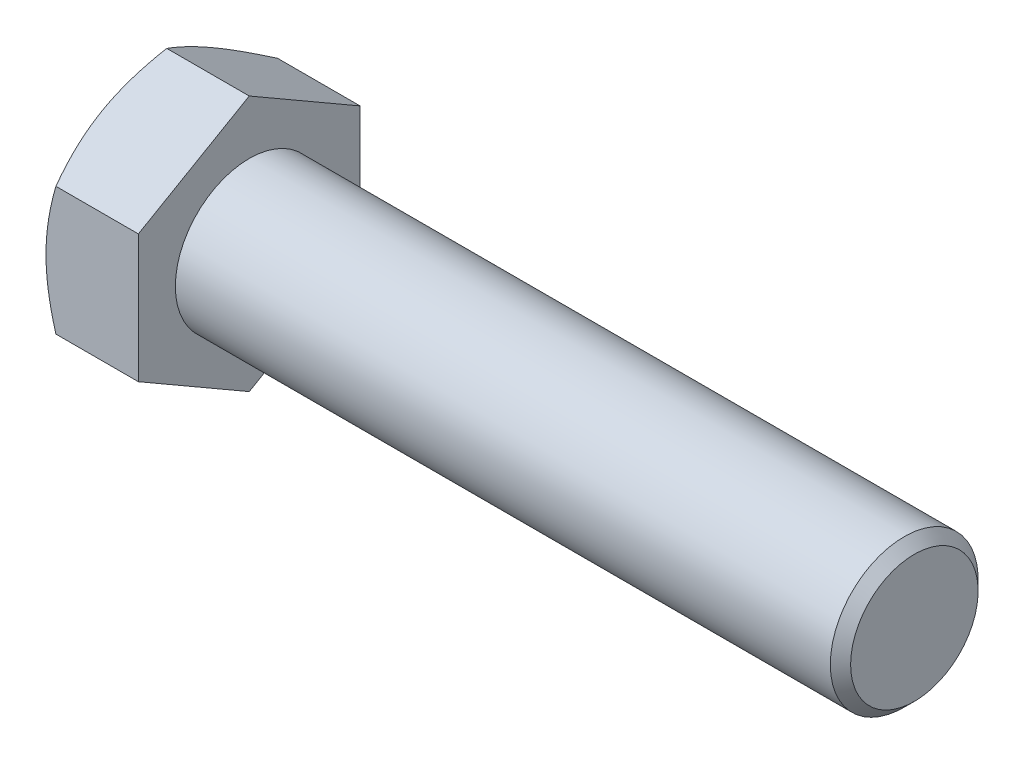
ISO-10303-21;
HEADER;
FILE_DESCRIPTION(('STEP AP214'),'2;1');
FILE_NAME('part.step','',(''),(''),'','','');
FILE_SCHEMA(('AUTOMOTIVE_DESIGN { 1 0 10303 214 1 1 1 1 }'));
ENDSEC;
DATA;
#1=APPLICATION_CONTEXT('core data for automotive mechanical design processes');
#2=APPLICATION_PROTOCOL_DEFINITION('international standard','automotive_design',2000,#1);
#3=PRODUCT_CONTEXT('',#1,'mechanical');
#4=PRODUCT('Part','Part','',(#3));
#5=PRODUCT_RELATED_PRODUCT_CATEGORY('part','',(#4));
#6=PRODUCT_DEFINITION_FORMATION('','',#4);
#7=PRODUCT_DEFINITION_CONTEXT('part definition',#1,'design');
#8=PRODUCT_DEFINITION('design','',#6,#7);
#9=PRODUCT_DEFINITION_SHAPE('','',#8);
#10=(LENGTH_UNIT() NAMED_UNIT(*) SI_UNIT(.MILLI.,.METRE.));
#11=(NAMED_UNIT(*) PLANE_ANGLE_UNIT() SI_UNIT($,.RADIAN.));
#12=(NAMED_UNIT(*) SI_UNIT($,.STERADIAN.) SOLID_ANGLE_UNIT());
#13=UNCERTAINTY_MEASURE_WITH_UNIT(LENGTH_MEASURE(1.E-05),#10,'distance_accuracy_value','');
#14=(GEOMETRIC_REPRESENTATION_CONTEXT(3) GLOBAL_UNCERTAINTY_ASSIGNED_CONTEXT((#13)) GLOBAL_UNIT_ASSIGNED_CONTEXT((#10,
#11,#12)) REPRESENTATION_CONTEXT('',''));
#15=CARTESIAN_POINT('',(0.,0.,0.));
#16=DIRECTION('',(0.,0.,1.));
#17=DIRECTION('',(1.,0.,0.));
#18=AXIS2_PLACEMENT_3D('',#15,#16,#17);
#19=CARTESIAN_POINT('',(12.5,8.66025403784437,-15.));
#20=DIRECTION('',(0.,-0.866025403784438,0.500000000000001));
#21=DIRECTION('',(0.,-0.500000000000001,-0.866025403784438));
#22=AXIS2_PLACEMENT_3D('',#19,#20,#21);
#23=PLANE('',#22);
#24=CARTESIAN_POINT('',(1.33981262948894,17.3206235457426,0.000199999999999942));
#25=CARTESIAN_POINT('',(1.22992178974394,17.130274565913,-0.329494104233798));
#26=CARTESIAN_POINT('',(1.12501758932861,16.939183122782,-0.660474192628298));
#27=CARTESIAN_POINT('',(0.926568581943105,16.5554679079492,-1.32508844035602));
#28=CARTESIAN_POINT('',(0.833027511049495,16.3628436543361,-1.6587234343838));
#29=CARTESIAN_POINT('',(0.658562147609862,15.9756905506624,-2.32929228025473));
#30=CARTESIAN_POINT('',(0.57766770660219,15.7811583127512,-2.66623200002701));
#31=CARTESIAN_POINT('',(0.430232643422046,15.3907420734253,-3.34245276263938));
#32=CARTESIAN_POINT('',(0.363691202381329,15.1948581497855,-3.68173367076951));
#33=CARTESIAN_POINT('',(0.24779237469631,14.8067578304067,-4.35394314236732));
#34=CARTESIAN_POINT('',(0.198051383436667,14.6145702475688,-4.68682180042634));
#35=CARTESIAN_POINT('',(0.114646749003608,14.2293144416655,-5.3541044301617));
#36=CARTESIAN_POINT('',(0.0809834152900872,14.0362462017216,-5.68850843107249));
#37=CARTESIAN_POINT('',(0.0305840757080842,13.6497853945792,-6.35787818417715));
#38=CARTESIAN_POINT('',(0.0138279549580496,13.4563934876199,-6.69284279280335));
#39=CARTESIAN_POINT('',(-0.00239660617302373,13.0694311550724,-7.363081213391));
#40=CARTESIAN_POINT('',(-0.00186558072758146,12.8758607351851,-7.69835501547824));
#41=CARTESIAN_POINT('',(0.0152766129981647,12.5139822792559,-8.3251468873122));
#42=CARTESIAN_POINT('',(0.0297968460490102,12.3456484541475,-8.61670962503242));
#43=CARTESIAN_POINT('',(0.0716371404224067,12.0093680110861,-9.19916443800648));
#44=CARTESIAN_POINT('',(0.0989581071094724,11.8414214213658,-9.49005646435989));
#45=CARTESIAN_POINT('',(0.165923511998901,11.5060066717823,-10.0710118522466));
#46=CARTESIAN_POINT('',(0.205578128270658,11.338539022767,-10.3610743289652));
#47=CARTESIAN_POINT('',(0.296515103017898,11.0043888432043,-10.939839417326));
#48=CARTESIAN_POINT('',(0.347798251969253,10.8377063668174,-11.2285419351595));
#49=CARTESIAN_POINT('',(0.520386864747102,10.3317324659531,-12.1049144387604));
#50=CARTESIAN_POINT('',(0.658901178256925,9.99390625559023,-12.6900465992373));
#51=CARTESIAN_POINT('',(0.973271968475207,9.32329122184509,-13.8515859100034));
#52=CARTESIAN_POINT('',(1.14905461461787,8.99049381241394,-14.4280079317654));
#53=CARTESIAN_POINT('',(1.33981262948893,8.66013856779053,-15.0002));
#54=B_SPLINE_CURVE_WITH_KNOTS('',3,(#24,#25,#26,#27,#28,#29,#30,#31,#32,#33,#34,#35,#36,#37,#38,
#39,#40,#41,#42,#43,#44,#45,#46,#47,#48,#49,#50,#51,#52,#53),.UNSPECIFIED.,.F.,.F.,(4,2,2,2,2,2,
2,2,2,2,2,2,2,2,4),(0.,1.18875411504163,2.37789802800057,3.56980778300395,4.76164951910136,
5.92407379683759,7.08652044780812,8.24758247406078,9.40860862348376,10.4193068498566,
11.4300765712312,12.4416826308653,13.4533574773408,15.5211962051185,17.5849760846241),.UNSPECIFIED.);
#55=CARTESIAN_POINT('',(1.33974596215561,17.3205080756888,0.));
#56=VERTEX_POINT('',#55);
#57=CARTESIAN_POINT('',(0.,12.9903810567666,-7.50000000000002));
#58=VERTEX_POINT('',#57);
#59=EDGE_CURVE('E50',#56,#58,#54,.T.);
#60=ORIENTED_EDGE('',*,*,#59,.F.);
#61=DIRECTION('',(-1.,0.,0.));
#62=VECTOR('',#61,1.);
#63=CARTESIAN_POINT('',(12.5,17.3205080756888,0.));
#64=LINE('',#63,#62);
#65=CARTESIAN_POINT('',(12.5,17.3205080756888,0.));
#66=VERTEX_POINT('',#65);
#67=EDGE_CURVE('E146',#66,#56,#64,.T.);
#68=ORIENTED_EDGE('',*,*,#67,.F.);
#69=DIRECTION('',(0.,0.500000000000001,0.866025403784438));
#70=VECTOR('',#69,1.);
#71=CARTESIAN_POINT('',(12.5,8.66025403784437,-15.));
#72=LINE('',#71,#70);
#73=CARTESIAN_POINT('',(12.5,8.66025403784437,-15.));
#74=VERTEX_POINT('',#73);
#75=EDGE_CURVE('E237',#74,#66,#72,.T.);
#76=ORIENTED_EDGE('',*,*,#75,.F.);
#77=DIRECTION('',(-1.,0.,0.));
#78=VECTOR('',#77,1.);
#79=CARTESIAN_POINT('',(12.5,8.66025403784437,-15.));
#80=LINE('',#79,#78);
#81=CARTESIAN_POINT('',(1.3397459621556,8.66025403784437,-15.));
#82=VERTEX_POINT('',#81);
#83=EDGE_CURVE('E134',#74,#82,#80,.T.);
#84=ORIENTED_EDGE('',*,*,#83,.T.);
#85=EDGE_CURVE('E128',#58,#82,#54,.T.);
#86=ORIENTED_EDGE('',*,*,#85,.F.);
#87=EDGE_LOOP('',(#60,#68,#76,#84,#86));
#88=FACE_BOUND('',#87,.T.);
#89=ADVANCED_FACE('F34',(#88),#23,.F.);
#90=CARTESIAN_POINT('',(12.5,17.3205080756888,0.));
#91=DIRECTION('',(0.,-0.866025403784438,-0.500000000000002));
#92=DIRECTION('',(0.,0.500000000000002,-0.866025403784438));
#93=AXIS2_PLACEMENT_3D('',#90,#91,#92);
#94=PLANE('',#93);
#95=CARTESIAN_POINT('',(1.33981262948893,8.66013856779052,15.0002));
#96=CARTESIAN_POINT('',(1.22992178974393,8.85048754762014,14.6705058957662));
#97=CARTESIAN_POINT('',(1.1250175893286,9.04157899075111,14.3395258073717));
#98=CARTESIAN_POINT('',(0.926568581943094,9.42529420558397,13.674911559644));
#99=CARTESIAN_POINT('',(0.833027511049484,9.61791845919699,13.3412765656162));
#100=CARTESIAN_POINT('',(0.658562147609853,10.0050715628707,12.6707077197453));
#101=CARTESIAN_POINT('',(0.577667706602182,10.1996038007819,12.333767999973));
#102=CARTESIAN_POINT('',(0.430232643422039,10.5900200401078,11.6575472373606));
#103=CARTESIAN_POINT('',(0.36369120238132,10.7859039637476,11.3182663292305));
#104=CARTESIAN_POINT('',(0.247792374696303,11.1740042831265,10.6460568576327));
#105=CARTESIAN_POINT('',(0.198051383436661,11.3661918659643,10.3131781995737));
#106=CARTESIAN_POINT('',(0.114646749003604,11.7514476718676,9.64589556983832));
#107=CARTESIAN_POINT('',(0.0809834152900836,11.9445159118115,9.31149156892752));
#108=CARTESIAN_POINT('',(0.0305840757080808,12.3309767189539,8.64212181582286));
#109=CARTESIAN_POINT('',(0.0138279549580458,12.5243686259132,8.30715720719666));
#110=CARTESIAN_POINT('',(-0.00239660617302695,12.9113309584607,7.63691878660901));
#111=CARTESIAN_POINT('',(-0.00186558072758385,13.104901378348,7.30164498452177));
#112=CARTESIAN_POINT('',(0.0152766129981631,13.4667798342772,6.67485311268781));
#113=CARTESIAN_POINT('',(0.0297968460490087,13.6351136593857,6.38329037496759));
#114=CARTESIAN_POINT('',(0.0716371404224057,13.971394102447,5.80083556199353));
#115=CARTESIAN_POINT('',(0.0989581071094717,14.1393406921673,5.50994353564012));
#116=CARTESIAN_POINT('',(0.165923511998901,14.4747554417509,4.92898814775339));
#117=CARTESIAN_POINT('',(0.205578128270658,14.6422230907661,4.63892567103483));
#118=CARTESIAN_POINT('',(0.2965151030179,14.9763732703288,4.06016058267397));
#119=CARTESIAN_POINT('',(0.347798251969255,15.1430557467157,3.77145806484048));
#120=CARTESIAN_POINT('',(0.520386864747105,15.6490296475801,2.8950855612396));
#121=CARTESIAN_POINT('',(0.658901178256929,15.9868558579429,2.30995340076275));
#122=CARTESIAN_POINT('',(0.973271968475213,16.6574708916881,1.14841408999664));
#123=CARTESIAN_POINT('',(1.14905461461788,16.9902683011192,0.571992068234589));
#124=CARTESIAN_POINT('',(1.33981262948894,17.3206235457426,-0.000199999999999061));
#125=B_SPLINE_CURVE_WITH_KNOTS('',3,(#95,#96,#97,#98,#99,#100,#101,#102,#103,#104,#105,#106,
#107,#108,#109,#110,#111,#112,#113,#114,#115,#116,#117,#118,#119,#120,#121,#122,#123,#124),
.UNSPECIFIED.,.F.,.F.,(4,2,2,2,2,2,2,2,2,2,2,2,2,2,4),(0.,1.18875411504162,2.37789802800056,
3.56980778300394,4.76164951910135,5.92407379683757,7.0865204478081,8.24758247406077,
9.40860862348375,10.4193068498566,11.4300765712312,12.4416826308653,13.4533574773408,
15.5211962051185,17.5849760846241),.UNSPECIFIED.);
#126=CARTESIAN_POINT('',(1.3397459621556,8.66025403784436,15.));
#127=VERTEX_POINT('',#126);
#128=CARTESIAN_POINT('',(0.,12.9903810567666,7.50000000000002));
#129=VERTEX_POINT('',#128);
#130=EDGE_CURVE('E57',#127,#129,#125,.T.);
#131=ORIENTED_EDGE('',*,*,#130,.F.);
#132=DIRECTION('',(-1.,0.,0.));
#133=VECTOR('',#132,1.);
#134=CARTESIAN_POINT('',(12.5,8.66025403784436,15.));
#135=LINE('',#134,#133);
#136=CARTESIAN_POINT('',(12.5,8.66025403784436,15.));
#137=VERTEX_POINT('',#136);
#138=EDGE_CURVE('E144',#137,#127,#135,.T.);
#139=ORIENTED_EDGE('',*,*,#138,.F.);
#140=DIRECTION('',(0.,-0.500000000000002,0.866025403784438));
#141=VECTOR('',#140,1.);
#142=CARTESIAN_POINT('',(12.5,17.3205080756888,0.));
#143=LINE('',#142,#141);
#144=EDGE_CURVE('E235',#66,#137,#143,.T.);
#145=ORIENTED_EDGE('',*,*,#144,.F.);
#146=ORIENTED_EDGE('',*,*,#67,.T.);
#147=EDGE_CURVE('E161',#129,#56,#125,.T.);
#148=ORIENTED_EDGE('',*,*,#147,.F.);
#149=EDGE_LOOP('',(#131,#139,#145,#146,#148));
#150=FACE_BOUND('',#149,.T.);
#151=ADVANCED_FACE('F167',(#150),#94,.F.);
#152=CARTESIAN_POINT('',(12.5,8.66025403784436,15.));
#153=DIRECTION('',(0.,0.,-1.));
#154=DIRECTION('',(0.,1.,0.));
#155=AXIS2_PLACEMENT_3D('',#152,#153,#154);
#156=PLANE('',#155);
#157=CARTESIAN_POINT('',(7.37312634142274,-23.3710902432644,15.));
#158=CARTESIAN_POINT('',(7.21375262239754,-23.0430760696959,15.));
#159=CARTESIAN_POINT('',(7.05516544065869,-22.7146799177878,15.));
#160=CARTESIAN_POINT('',(6.73974206992199,-22.0570439860333,15.));
#161=CARTESIAN_POINT('',(6.58290589820193,-21.7278041979018,15.));
#162=CARTESIAN_POINT('',(6.11525014314407,-20.7386136979432,15.));
#163=CARTESIAN_POINT('',(5.80732977425762,-20.0772872007942,15.));
#164=CARTESIAN_POINT('',(5.19942693023618,-18.7466975911013,15.));
#165=CARTESIAN_POINT('',(4.89949586126698,-18.0774109369937,15.));
#166=CARTESIAN_POINT('',(4.31175828291556,-16.7335531331124,15.));
#167=CARTESIAN_POINT('',(4.02395120803105,-16.0589822315577,15.));
#168=CARTESIAN_POINT('',(3.45448123526224,-14.6812618349881,15.));
#169=CARTESIAN_POINT('',(3.17332879671134,-13.9779002519057,15.));
#170=CARTESIAN_POINT('',(2.63203971838782,-12.5629833864443,15.));
#171=CARTESIAN_POINT('',(2.37190542218014,-11.8514272004293,15.));
#172=CARTESIAN_POINT('',(1.87940642787692,-10.4203092780316,15.));
#173=CARTESIAN_POINT('',(1.64698643360295,-9.70076672348861,15.));
#174=CARTESIAN_POINT('',(1.21728875052384,-8.25129237895164,15.));
#175=CARTESIAN_POINT('',(1.0200001067189,-7.52136390453811,15.));
#176=CARTESIAN_POINT('',(0.7580440110938,-6.42057854331659,15.));
#177=CARTESIAN_POINT('',(0.676568269179388,-6.05369801830712,15.));
#178=CARTESIAN_POINT('',(0.525901265988502,-5.31741005070265,15.));
#179=CARTESIAN_POINT('',(0.456709757577166,-4.94800265909859,15.));
#180=CARTESIAN_POINT('',(0.33182565121759,-4.20690684273659,15.));
#181=CARTESIAN_POINT('',(0.276132866007175,-3.8352184496954,15.));
#182=CARTESIAN_POINT('',(0.179353464490729,-3.08994807461034,15.));
#183=CARTESIAN_POINT('',(0.138266210233164,-2.71636617599557,15.));
#184=CARTESIAN_POINT('',(0.0720349282598907,-1.9727530881515,15.));
#185=CARTESIAN_POINT('',(0.0466876247564246,-1.60274011577422,15.));
#186=CARTESIAN_POINT('',(0.0116690165370457,-0.861974178810336,15.));
#187=CARTESIAN_POINT('',(0.00199744873685079,-0.4912212267473,15.));
#188=CARTESIAN_POINT('',(-0.00143922525530451,0.250361888695027,15.));
#189=CARTESIAN_POINT('',(0.0047957085902485,0.621192052266315,15.));
#190=CARTESIAN_POINT('',(0.033018606999258,1.36225664266281,15.));
#191=CARTESIAN_POINT('',(0.0550072763077505,1.73249104209379,15.));
#192=CARTESIAN_POINT('',(0.126051292077782,2.61901692353103,15.));
#193=CARTESIAN_POINT('',(0.182399811323722,3.13473445449997,15.));
#194=CARTESIAN_POINT('',(0.322620708796107,4.16241630719729,15.));
#195=CARTESIAN_POINT('',(0.406496739416164,4.67438012165624,15.));
#196=CARTESIAN_POINT('',(0.598789077426748,5.69404144186671,15.));
#197=CARTESIAN_POINT('',(0.707224211030175,6.20173536317269,15.));
#198=CARTESIAN_POINT('',(0.945319562147973,7.21206683369576,15.));
#199=CARTESIAN_POINT('',(1.07497948319508,7.71470445343506,15.));
#200=CARTESIAN_POINT('',(1.35544197293366,8.72603000117139,15.));
#201=CARTESIAN_POINT('',(1.50664978249796,9.23460476310561,15.));
#202=CARTESIAN_POINT('',(1.8249043676015,10.2467458711939,15.));
#203=CARTESIAN_POINT('',(1.99195124865291,10.7503121839595,15.));
#204=CARTESIAN_POINT('',(2.33921280491136,11.7526813564513,15.));
#205=CARTESIAN_POINT('',(2.51942324334105,12.2514856909171,15.));
#206=CARTESIAN_POINT('',(2.89087066982044,13.2449469454003,15.));
#207=CARTESIAN_POINT('',(3.08210752223135,13.7396039163498,15.));
#208=CARTESIAN_POINT('',(3.54947439370891,14.9157121556281,15.));
#209=CARTESIAN_POINT('',(3.82985054040226,15.5954736275084,15.));
#210=CARTESIAN_POINT('',(4.40448813627647,16.9491200493053,15.));
#211=CARTESIAN_POINT('',(4.69875048827638,17.6230046137476,15.));
#212=CARTESIAN_POINT('',(5.29835231372321,18.9660045580938,15.));
#213=CARTESIAN_POINT('',(5.60369438101907,19.6351187767802,15.));
#214=CARTESIAN_POINT('',(6.22319663175735,20.9692236125686,15.));
#215=CARTESIAN_POINT('',(6.53735661587308,21.6342143224672,15.));
#216=CARTESIAN_POINT('',(7.17319119787561,22.9615174114887,15.));
#217=CARTESIAN_POINT('',(7.49487393687324,23.6238258837404,15.));
#218=CARTESIAN_POINT('',(8.1441131839965,24.9455571763282,15.));
#219=CARTESIAN_POINT('',(8.47166971887489,25.6049799835043,15.));
#220=CARTESIAN_POINT('',(9.13159579207327,26.921298055173,15.));
#221=CARTESIAN_POINT('',(9.4639646698903,27.5781936511553,15.));
#222=CARTESIAN_POINT('',(10.1327647298128,28.8899147680427,15.));
#223=CARTESIAN_POINT('',(10.4691959281476,29.5447402806644,15.));
#224=CARTESIAN_POINT('',(11.4259204903036,31.3950227195849,15.));
#225=CARTESIAN_POINT('',(12.0502117954095,32.5884123640315,15.));
#226=CARTESIAN_POINT('',(13.3073006205493,34.9707491110887,15.));
#227=CARTESIAN_POINT('',(13.9400984568651,36.1596960464025,15.));
#228=CARTESIAN_POINT('',(15.2105565669476,38.5310463582308,15.));
#229=CARTESIAN_POINT('',(15.848200115734,39.7134587013795,15.));
#230=CARTESIAN_POINT('',(16.8084387509036,41.4849860606789,15.));
#231=CARTESIAN_POINT('',(17.1291381447726,42.0751301522637,15.));
#232=CARTESIAN_POINT('',(17.7716684887013,43.2548008793538,15.));
#233=CARTESIAN_POINT('',(18.093499437005,43.8443275158156,15.));
#234=CARTESIAN_POINT('',(18.4158306352953,44.4335805858711,15.));
#235=B_SPLINE_CURVE_WITH_KNOTS('',3,(#157,#158,#159,#160,#161,#162,#163,#164,#165,#166,#167,
#168,#169,#170,#171,#172,#173,#174,#175,#176,#177,#178,#179,#180,#181,#182,#183,#184,#185,#186,
#187,#188,#189,#190,#191,#192,#193,#194,#195,#196,#197,#198,#199,#200,#201,#202,#203,#204,#205,
#206,#207,#208,#209,#210,#211,#212,#213,#214,#215,#216,#217,#218,#219,#220,#221,#222,#223,#224,
#225,#226,#227,#228,#229,#230,#231,#232,#233,#234),.UNSPECIFIED.,.F.,.F.,(4,2,2,2,2,2,2,2,2,2,2,
2,2,2,2,2,2,2,2,2,2,2,2,2,2,2,2,2,2,2,2,2,2,2,2,2,2,2,4),(0.,1.09404536556372,2.18810151691039,
4.37653199540515,6.5766949197864,8.77675510756671,11.0489153528487,13.3213285999183,
15.5891291984257,17.8562213861602,18.9835047922636,20.1107655170493,21.2380106029203,
22.3652064460679,23.4775244996214,24.5898238850606,25.7021260702194,26.8144780174424,
28.369980084541,29.9256886216007,31.4825937751784,33.039477183802,34.6309007090225,
36.2223348362746,37.8132589879854,39.4041635734972,41.6098943791885,43.8157687897567,
46.0221629875906,48.2285073505644,50.4373613430439,52.6462253985176,54.854789104351,
57.0633616365132,61.1037632942179,65.1443155962395,69.1744593178455,71.1894182926913,
73.2043741418614),.UNSPECIFIED.);
#236=CARTESIAN_POINT('',(1.3397459621556,-8.66025403784438,15.));
#237=VERTEX_POINT('',#236);
#238=CARTESIAN_POINT('',(0.,0.,15.));
#239=VERTEX_POINT('',#238);
#240=EDGE_CURVE('E247',#237,#239,#235,.T.);
#241=ORIENTED_EDGE('',*,*,#240,.F.);
#242=DIRECTION('',(-1.,0.,0.));
#243=VECTOR('',#242,1.);
#244=CARTESIAN_POINT('',(12.5,-8.66025403784438,15.));
#245=LINE('',#244,#243);
#246=CARTESIAN_POINT('',(12.5,-8.66025403784438,15.));
#247=VERTEX_POINT('',#246);
#248=EDGE_CURVE('E136',#247,#237,#245,.T.);
#249=ORIENTED_EDGE('',*,*,#248,.F.);
#250=DIRECTION('',(0.,-1.,0.));
#251=VECTOR('',#250,1.);
#252=CARTESIAN_POINT('',(12.5,8.66025403784436,15.));
#253=LINE('',#252,#251);
#254=EDGE_CURVE('E231',#137,#247,#253,.T.);
#255=ORIENTED_EDGE('',*,*,#254,.F.);
#256=ORIENTED_EDGE('',*,*,#138,.T.);
#257=EDGE_CURVE('E185',#239,#127,#235,.T.);
#258=ORIENTED_EDGE('',*,*,#257,.F.);
#259=EDGE_LOOP('',(#241,#249,#255,#256,#258));
#260=FACE_BOUND('',#259,.T.);
#261=ADVANCED_FACE('F253',(#260),#156,.F.);
#262=CARTESIAN_POINT('',(12.5,-17.3205080756888,0.));
#263=DIRECTION('',(0.,0.866025403784437,-0.500000000000002));
#264=DIRECTION('',(0.,0.500000000000002,0.866025403784438));
#265=AXIS2_PLACEMENT_3D('',#262,#263,#264);
#266=PLANE('',#265);
#267=CARTESIAN_POINT('',(1.33981262948896,-17.3206235457426,-0.000200000000000009));
#268=CARTESIAN_POINT('',(1.22992178974396,-17.130274565913,0.3294941042338));
#269=CARTESIAN_POINT('',(1.12501758932863,-16.9391831227821,0.6604741926283));
#270=CARTESIAN_POINT('',(0.926568581943121,-16.5554679079492,1.32508844035602));
#271=CARTESIAN_POINT('',(0.833027511049511,-16.3628436543362,1.6587234343838));
#272=CARTESIAN_POINT('',(0.658562147609877,-15.9756905506624,2.32929228025473));
#273=CARTESIAN_POINT('',(0.577667706602204,-15.7811583127512,2.66623200002701));
#274=CARTESIAN_POINT('',(0.430232643422059,-15.3907420734253,3.34245276263938));
#275=CARTESIAN_POINT('',(0.363691202381342,-15.1948581497855,3.68173367076951));
#276=CARTESIAN_POINT('',(0.247792374696323,-14.8067578304067,4.35394314236732));
#277=CARTESIAN_POINT('',(0.19805138343668,-14.6145702475688,4.68682180042634));
#278=CARTESIAN_POINT('',(0.114646749003621,-14.2293144416656,5.3541044301617));
#279=CARTESIAN_POINT('',(0.0809834152900995,-14.0362462017216,5.6885084310725));
#280=CARTESIAN_POINT('',(0.0305840757080953,-13.6497853945793,6.35787818417716));
#281=CARTESIAN_POINT('',(0.0138279549580597,-13.4563934876199,6.69284279280336));
#282=CARTESIAN_POINT('',(-0.00239660617301325,-13.0694311550724,7.36308121339101));
#283=CARTESIAN_POINT('',(-0.00186558072756965,-12.8758607351851,7.69835501547825));
#284=CARTESIAN_POINT('',(0.0152766129981765,-12.5139822792559,8.32514688731221));
#285=CARTESIAN_POINT('',(0.029796846049021,-12.3456484541475,8.61670962503243));
#286=CARTESIAN_POINT('',(0.0716371404224159,-12.0093680110861,9.19916443800648));
#287=CARTESIAN_POINT('',(0.0989581071094809,-11.8414214213659,9.49005646435989));
#288=CARTESIAN_POINT('',(0.165923511998909,-11.5060066717823,10.0710118522466));
#289=CARTESIAN_POINT('',(0.205578128270666,-11.338539022767,10.3610743289652));
#290=CARTESIAN_POINT('',(0.296515103017907,-11.0043888432043,10.939839417326));
#291=CARTESIAN_POINT('',(0.34779825196926,-10.8377063668174,11.2285419351595));
#292=CARTESIAN_POINT('',(0.520386864747107,-10.3317324659531,12.1049144387604));
#293=CARTESIAN_POINT('',(0.658901178256929,-9.99390625559025,12.6900465992373));
#294=CARTESIAN_POINT('',(0.97327196847521,-9.3232912218451,13.8515859100034));
#295=CARTESIAN_POINT('',(1.14905461461787,-8.99049381241395,14.4280079317654));
#296=CARTESIAN_POINT('',(1.33981262948893,-8.66013856779054,15.0002));
#297=B_SPLINE_CURVE_WITH_KNOTS('',3,(#267,#268,#269,#270,#271,#272,#273,#274,#275,#276,#277,
#278,#279,#280,#281,#282,#283,#284,#285,#286,#287,#288,#289,#290,#291,#292,#293,#294,#295,#296),
.UNSPECIFIED.,.F.,.F.,(4,2,2,2,2,2,2,2,2,2,2,2,2,2,4),(0.,1.18875411504163,2.37789802800057,
3.56980778300395,4.76164951910136,5.92407379683759,7.08652044780812,8.24758247406079,
9.40860862348378,10.4193068498566,11.4300765712312,12.4416826308653,13.4533574773408,
15.5211962051185,17.5849760846241),.UNSPECIFIED.);
#298=CARTESIAN_POINT('',(1.33974596215563,-17.3205080756888,0.));
#299=VERTEX_POINT('',#298);
#300=CARTESIAN_POINT('',(0.,-12.9903810567666,7.50000000000003));
#301=VERTEX_POINT('',#300);
#302=EDGE_CURVE('E169',#299,#301,#297,.T.);
#303=ORIENTED_EDGE('',*,*,#302,.F.);
#304=DIRECTION('',(-1.,0.,0.));
#305=VECTOR('',#304,1.);
#306=CARTESIAN_POINT('',(12.5,-17.3205080756888,0.));
#307=LINE('',#306,#305);
#308=CARTESIAN_POINT('',(12.5,-17.3205080756888,0.));
#309=VERTEX_POINT('',#308);
#310=EDGE_CURVE('E133',#309,#299,#307,.T.);
#311=ORIENTED_EDGE('',*,*,#310,.F.);
#312=DIRECTION('',(0.,-0.500000000000002,-0.866025403784437));
#313=VECTOR('',#312,1.);
#314=CARTESIAN_POINT('',(12.5,-17.3205080756888,0.));
#315=LINE('',#314,#313);
#316=EDGE_CURVE('E229',#247,#309,#315,.T.);
#317=ORIENTED_EDGE('',*,*,#316,.F.);
#318=ORIENTED_EDGE('',*,*,#248,.T.);
#319=EDGE_CURVE('E171',#301,#237,#297,.T.);
#320=ORIENTED_EDGE('',*,*,#319,.F.);
#321=EDGE_LOOP('',(#303,#311,#317,#318,#320));
#322=FACE_BOUND('',#321,.T.);
#323=ADVANCED_FACE('F225',(#322),#266,.F.);
#324=CARTESIAN_POINT('',(12.5,-8.66025403784441,-15.));
#325=DIRECTION('',(0.,0.866025403784438,0.500000000000001));
#326=DIRECTION('',(0.,-0.500000000000001,0.866025403784438));
#327=AXIS2_PLACEMENT_3D('',#324,#325,#326);
#328=PLANE('',#327);
#329=CARTESIAN_POINT('',(1.33981262948894,-8.66013856779057,-15.0002));
#330=CARTESIAN_POINT('',(1.22992178974394,-8.85048754762019,-14.6705058957662));
#331=CARTESIAN_POINT('',(1.12501758932861,-9.04157899075116,-14.3395258073717));
#332=CARTESIAN_POINT('',(0.926568581943109,-9.42529420558402,-13.674911559644));
#333=CARTESIAN_POINT('',(0.8330275110495,-9.61791845919704,-13.3412765656162));
#334=CARTESIAN_POINT('',(0.658562147609868,-10.0050715628708,-12.6707077197453));
#335=CARTESIAN_POINT('',(0.577667706602196,-10.199603800782,-12.333767999973));
#336=CARTESIAN_POINT('',(0.430232643422053,-10.5900200401079,-11.6575472373606));
#337=CARTESIAN_POINT('',(0.363691202381337,-10.7859039637477,-11.3182663292305));
#338=CARTESIAN_POINT('',(0.24779237469632,-11.1740042831265,-10.6460568576327));
#339=CARTESIAN_POINT('',(0.198051383436678,-11.3661918659644,-10.3131781995737));
#340=CARTESIAN_POINT('',(0.114646749003621,-11.7514476718676,-9.6458955698383));
#341=CARTESIAN_POINT('',(0.0809834152901002,-11.9445159118116,-9.3114915689275));
#342=CARTESIAN_POINT('',(0.0305840757080983,-12.3309767189539,-8.64212181582284));
#343=CARTESIAN_POINT('',(0.0138279549580643,-12.5243686259133,-8.30715720719664));
#344=CARTESIAN_POINT('',(-0.00239660617300746,-12.9113309584608,-7.63691878660899));
#345=CARTESIAN_POINT('',(-0.00186558072756433,-13.1049013783481,-7.30164498452175));
#346=CARTESIAN_POINT('',(0.015276612998184,-13.4667798342773,-6.67485311268779));
#347=CARTESIAN_POINT('',(0.0297968460490307,-13.6351136593857,-6.38329037496757));
#348=CARTESIAN_POINT('',(0.0716371404224283,-13.9713941024471,-5.80083556199352));
#349=CARTESIAN_POINT('',(0.0989581071094939,-14.1393406921673,-5.50994353564011));
#350=CARTESIAN_POINT('',(0.165923511998923,-14.4747554417509,-4.92898814775337));
#351=CARTESIAN_POINT('',(0.20557812827068,-14.6422230907662,-4.63892567103481));
#352=CARTESIAN_POINT('',(0.296515103017922,-14.9763732703289,-4.06016058267396));
#353=CARTESIAN_POINT('',(0.347798251969277,-15.1430557467158,-3.77145806484047));
#354=CARTESIAN_POINT('',(0.520386864747127,-15.6490296475801,-2.89508556123959));
#355=CARTESIAN_POINT('',(0.658901178256949,-15.9868558579429,-2.30995340076274));
#356=CARTESIAN_POINT('',(0.97327196847523,-16.6574708916881,-1.14841408999664));
#357=CARTESIAN_POINT('',(1.14905461461789,-16.9902683011192,-0.571992068234584));
#358=CARTESIAN_POINT('',(1.33981262948895,-17.3206235457426,0.000200000000000249));
#359=B_SPLINE_CURVE_WITH_KNOTS('',3,(#329,#330,#331,#332,#333,#334,#335,#336,#337,#338,#339,
#340,#341,#342,#343,#344,#345,#346,#347,#348,#349,#350,#351,#352,#353,#354,#355,#356,#357,#358),
.UNSPECIFIED.,.F.,.F.,(4,2,2,2,2,2,2,2,2,2,2,2,2,2,4),(0.,1.18875411504163,2.37789802800057,
3.56980778300395,4.76164951910136,5.92407379683759,7.08652044780812,8.24758247406078,
9.40860862348377,10.4193068498566,11.4300765712312,12.4416826308653,13.4533574773408,
15.5211962051185,17.5849760846241),.UNSPECIFIED.);
#360=CARTESIAN_POINT('',(1.33974596215561,-8.66025403784441,-15.));
#361=VERTEX_POINT('',#360);
#362=CARTESIAN_POINT('',(0.,-12.9903810567666,-7.50000000000001));
#363=VERTEX_POINT('',#362);
#364=EDGE_CURVE('E110',#361,#363,#359,.T.);
#365=ORIENTED_EDGE('',*,*,#364,.F.);
#366=DIRECTION('',(-1.,0.,0.));
#367=VECTOR('',#366,1.);
#368=CARTESIAN_POINT('',(12.5,-8.66025403784441,-15.));
#369=LINE('',#368,#367);
#370=CARTESIAN_POINT('',(12.5,-8.66025403784441,-15.));
#371=VERTEX_POINT('',#370);
#372=EDGE_CURVE('E124',#371,#361,#369,.T.);
#373=ORIENTED_EDGE('',*,*,#372,.F.);
#374=DIRECTION('',(0.,0.500000000000001,-0.866025403784438));
#375=VECTOR('',#374,1.);
#376=CARTESIAN_POINT('',(12.5,-8.66025403784441,-15.));
#377=LINE('',#376,#375);
#378=EDGE_CURVE('E227',#309,#371,#377,.T.);
#379=ORIENTED_EDGE('',*,*,#378,.F.);
#380=ORIENTED_EDGE('',*,*,#310,.T.);
#381=EDGE_CURVE('E127',#363,#299,#359,.T.);
#382=ORIENTED_EDGE('',*,*,#381,.F.);
#383=EDGE_LOOP('',(#365,#373,#379,#380,#382));
#384=FACE_BOUND('',#383,.T.);
#385=ADVANCED_FACE('F122',(#384),#328,.F.);
#386=CARTESIAN_POINT('',(12.5,8.66025403784437,-15.));
#387=DIRECTION('',(0.,0.,1.));
#388=DIRECTION('',(0.,-1.,0.));
#389=AXIS2_PLACEMENT_3D('',#386,#387,#388);
#390=PLANE('',#389);
#391=CARTESIAN_POINT('',(7.37312634142276,-23.3710902432644,-15.));
#392=CARTESIAN_POINT('',(7.21375262239756,-23.0430760696959,-15.));
#393=CARTESIAN_POINT('',(7.05516544065871,-22.7146799177878,-15.));
#394=CARTESIAN_POINT('',(6.73974206992201,-22.0570439860333,-15.));
#395=CARTESIAN_POINT('',(6.58290589820195,-21.7278041979018,-15.));
#396=CARTESIAN_POINT('',(6.11525014314409,-20.7386136979432,-15.));
#397=CARTESIAN_POINT('',(5.80732977425764,-20.0772872007942,-15.));
#398=CARTESIAN_POINT('',(5.19942693023619,-18.7466975911013,-15.));
#399=CARTESIAN_POINT('',(4.89949586126699,-18.0774109369937,-15.));
#400=CARTESIAN_POINT('',(4.31175828291557,-16.7335531331125,-15.));
#401=CARTESIAN_POINT('',(4.02395120803106,-16.0589822315577,-15.));
#402=CARTESIAN_POINT('',(3.45448123526225,-14.6812618349881,-15.));
#403=CARTESIAN_POINT('',(3.17332879671135,-13.9779002519057,-15.));
#404=CARTESIAN_POINT('',(2.63203971838783,-12.5629833864443,-15.));
#405=CARTESIAN_POINT('',(2.37190542218015,-11.8514272004293,-15.));
#406=CARTESIAN_POINT('',(1.87940642787693,-10.4203092780317,-15.));
#407=CARTESIAN_POINT('',(1.64698643360296,-9.70076672348863,-15.));
#408=CARTESIAN_POINT('',(1.21728875052385,-8.25129237895167,-15.));
#409=CARTESIAN_POINT('',(1.0200001067189,-7.52136390453814,-15.));
#410=CARTESIAN_POINT('',(0.758044011093806,-6.42057854331661,-15.));
#411=CARTESIAN_POINT('',(0.676568269179394,-6.05369801830715,-15.));
#412=CARTESIAN_POINT('',(0.525901265988506,-5.31741005070268,-15.));
#413=CARTESIAN_POINT('',(0.456709757577169,-4.94800265909862,-15.));
#414=CARTESIAN_POINT('',(0.331825651217593,-4.20690684273662,-15.));
#415=CARTESIAN_POINT('',(0.276132866007178,-3.83521844969542,-15.));
#416=CARTESIAN_POINT('',(0.179353464490732,-3.08994807461037,-15.));
#417=CARTESIAN_POINT('',(0.138266210233165,-2.71636617599559,-15.));
#418=CARTESIAN_POINT('',(0.0720349282598913,-1.97275308815152,-15.));
#419=CARTESIAN_POINT('',(0.0466876247564259,-1.60274011577424,-15.));
#420=CARTESIAN_POINT('',(0.0116690165370464,-0.861974178810361,-15.));
#421=CARTESIAN_POINT('',(0.00199744873685037,-0.491221226747324,-15.));
#422=CARTESIAN_POINT('',(-0.00143922525530609,0.250361888695005,-15.));
#423=CARTESIAN_POINT('',(0.00479570859024683,0.621192052266294,-15.));
#424=CARTESIAN_POINT('',(0.0330186069992556,1.36225664266279,-15.));
#425=CARTESIAN_POINT('',(0.0550072763077476,1.73249104209377,-15.));
#426=CARTESIAN_POINT('',(0.126051292077779,2.61901692353101,-15.));
#427=CARTESIAN_POINT('',(0.182399811323719,3.13473445449995,-15.));
#428=CARTESIAN_POINT('',(0.322620708796104,4.16241630719727,-15.));
#429=CARTESIAN_POINT('',(0.406496739416159,4.67438012165622,-15.));
#430=CARTESIAN_POINT('',(0.598789077426742,5.69404144186669,-15.));
#431=CARTESIAN_POINT('',(0.707224211030167,6.20173536317266,-15.));
#432=CARTESIAN_POINT('',(0.945319562147965,7.21206683369574,-15.));
#433=CARTESIAN_POINT('',(1.07497948319508,7.71470445343504,-15.));
#434=CARTESIAN_POINT('',(1.35544197293366,8.72603000117137,-15.));
#435=CARTESIAN_POINT('',(1.50664978249795,9.2346047631056,-15.));
#436=CARTESIAN_POINT('',(1.82490436760149,10.2467458711939,-15.));
#437=CARTESIAN_POINT('',(1.9919512486529,10.7503121839595,-15.));
#438=CARTESIAN_POINT('',(2.33921280491135,11.7526813564513,-15.));
#439=CARTESIAN_POINT('',(2.51942324334104,12.2514856909171,-15.));
#440=CARTESIAN_POINT('',(2.89087066982043,13.2449469454003,-15.));
#441=CARTESIAN_POINT('',(3.08210752223134,13.7396039163498,-15.));
#442=CARTESIAN_POINT('',(3.5494743937089,14.9157121556281,-15.));
#443=CARTESIAN_POINT('',(3.82985054040225,15.5954736275084,-15.));
#444=CARTESIAN_POINT('',(4.40448813627646,16.9491200493053,-15.));
#445=CARTESIAN_POINT('',(4.69875048827637,17.6230046137476,-15.));
#446=CARTESIAN_POINT('',(5.2983523137232,18.9660045580937,-15.));
#447=CARTESIAN_POINT('',(5.60369438101906,19.6351187767802,-15.));
#448=CARTESIAN_POINT('',(6.22319663175735,20.9692236125686,-15.));
#449=CARTESIAN_POINT('',(6.53735661587307,21.6342143224672,-15.));
#450=CARTESIAN_POINT('',(7.1731911978756,22.9615174114887,-15.));
#451=CARTESIAN_POINT('',(7.49487393687323,23.6238258837404,-15.));
#452=CARTESIAN_POINT('',(8.14411318399649,24.9455571763282,-15.));
#453=CARTESIAN_POINT('',(8.47166971887488,25.6049799835042,-15.));
#454=CARTESIAN_POINT('',(9.13159579207326,26.921298055173,-15.));
#455=CARTESIAN_POINT('',(9.46396466989029,27.5781936511553,-15.));
#456=CARTESIAN_POINT('',(10.1327647298128,28.8899147680427,-15.));
#457=CARTESIAN_POINT('',(10.4691959281476,29.5447402806644,-15.));
#458=CARTESIAN_POINT('',(11.4259204903036,31.3950227195848,-15.));
#459=CARTESIAN_POINT('',(12.0502117954095,32.5884123640315,-15.));
#460=CARTESIAN_POINT('',(13.3073006205493,34.9707491110888,-15.));
#461=CARTESIAN_POINT('',(13.9400984568651,36.1596960464025,-15.));
#462=CARTESIAN_POINT('',(15.2105565669476,38.5310463582308,-15.));
#463=CARTESIAN_POINT('',(15.848200115734,39.7134587013795,-15.));
#464=CARTESIAN_POINT('',(16.8084387509036,41.4849860606789,-15.));
#465=CARTESIAN_POINT('',(17.1291381447726,42.0751301522637,-15.));
#466=CARTESIAN_POINT('',(17.7716684887013,43.2548008793538,-15.));
#467=CARTESIAN_POINT('',(18.093499437005,43.8443275158156,-15.));
#468=CARTESIAN_POINT('',(18.4158306352953,44.4335805858711,-15.));
#469=B_SPLINE_CURVE_WITH_KNOTS('',3,(#391,#392,#393,#394,#395,#396,#397,#398,#399,#400,#401,
#402,#403,#404,#405,#406,#407,#408,#409,#410,#411,#412,#413,#414,#415,#416,#417,#418,#419,#420,
#421,#422,#423,#424,#425,#426,#427,#428,#429,#430,#431,#432,#433,#434,#435,#436,#437,#438,#439,
#440,#441,#442,#443,#444,#445,#446,#447,#448,#449,#450,#451,#452,#453,#454,#455,#456,#457,#458,
#459,#460,#461,#462,#463,#464,#465,#466,#467,#468),.UNSPECIFIED.,.F.,.F.,(4,2,2,2,2,2,2,2,2,2,2,
2,2,2,2,2,2,2,2,2,2,2,2,2,2,2,2,2,2,2,2,2,2,2,2,2,2,2,4),(0.,1.09404536556372,2.1881015169104,
4.37653199540515,6.57669491978641,8.77675510756671,11.0489153528487,13.3213285999184,
15.5891291984257,17.8562213861602,18.9835047922636,20.1107655170493,21.2380106029203,
22.3652064460679,23.4775244996214,24.5898238850606,25.7021260702195,26.8144780174424,
28.3699800845411,29.9256886216007,31.4825937751784,33.0394771838021,34.6309007090225,
36.2223348362746,37.8132589879854,39.4041635734972,41.6098943791885,43.8157687897567,
46.0221629875906,48.2285073505645,50.4373613430439,52.6462253985176,54.854789104351,
57.0633616365133,61.1037632942179,65.1443155962395,69.1744593178455,71.1894182926914,
73.2043741418615),.UNSPECIFIED.);
#470=CARTESIAN_POINT('',(0.,0.,-15.));
#471=VERTEX_POINT('',#470);
#472=EDGE_CURVE('E116',#82,#471,#469,.F.);
#473=ORIENTED_EDGE('',*,*,#472,.F.);
#474=ORIENTED_EDGE('',*,*,#83,.F.);
#475=DIRECTION('',(0.,1.,0.));
#476=VECTOR('',#475,1.);
#477=CARTESIAN_POINT('',(12.5,8.66025403784437,-15.));
#478=LINE('',#477,#476);
#479=EDGE_CURVE('E132',#371,#74,#478,.T.);
#480=ORIENTED_EDGE('',*,*,#479,.F.);
#481=ORIENTED_EDGE('',*,*,#372,.T.);
#482=EDGE_CURVE('E107',#471,#361,#469,.F.);
#483=ORIENTED_EDGE('',*,*,#482,.F.);
#484=EDGE_LOOP('',(#473,#474,#480,#481,#483));
#485=FACE_BOUND('',#484,.T.);
#486=ADVANCED_FACE('F130',(#485),#390,.F.);
#487=CARTESIAN_POINT('',(12.5,17.3205080756888,0.));
#488=DIRECTION('',(1.,0.,0.));
#489=DIRECTION('',(0.,0.,-1.));
#490=AXIS2_PLACEMENT_3D('',#487,#488,#489);
#491=PLANE('',#490);
#492=CARTESIAN_POINT('',(12.5,0.,0.));
#493=DIRECTION('',(1.,0.,0.));
#494=DIRECTION('',(0.,0.,-1.));
#495=AXIS2_PLACEMENT_3D('',#492,#493,#494);
#496=CIRCLE('',#495,10.);
#497=CARTESIAN_POINT('',(12.5,0.,-10.));
#498=VERTEX_POINT('',#497);
#499=EDGE_CURVE('E240',#498,#498,#496,.F.);
#500=ORIENTED_EDGE('',*,*,#499,.T.);
#501=EDGE_LOOP('',(#500));
#502=FACE_BOUND('',#501,.T.);
#503=ORIENTED_EDGE('',*,*,#75,.T.);
#504=ORIENTED_EDGE('',*,*,#144,.T.);
#505=ORIENTED_EDGE('',*,*,#254,.T.);
#506=ORIENTED_EDGE('',*,*,#316,.T.);
#507=ORIENTED_EDGE('',*,*,#378,.T.);
#508=ORIENTED_EDGE('',*,*,#479,.T.);
#509=EDGE_LOOP('',(#503,#504,#505,#506,#507,#508));
#510=FACE_BOUND('',#509,.T.);
#511=ADVANCED_FACE('F255',(#502,#510),#491,.T.);
#512=CARTESIAN_POINT('',(0.,0.,0.));
#513=DIRECTION('',(-1.,0.,0.));
#514=DIRECTION('',(0.,0.,1.));
#515=AXIS2_PLACEMENT_3D('',#512,#513,#514);
#516=CYLINDRICAL_SURFACE('',#515,10.);
#517=ORIENTED_EDGE('',*,*,#499,.F.);
#518=EDGE_LOOP('',(#517));
#519=FACE_BOUND('',#518,.T.);
#520=CARTESIAN_POINT('',(101.126,0.,0.));
#521=DIRECTION('',(-1.,0.,0.));
#522=DIRECTION('',(0.,0.,1.));
#523=AXIS2_PLACEMENT_3D('',#520,#521,#522);
#524=CIRCLE('',#523,10.);
#525=CARTESIAN_POINT('',(101.126,0.,10.));
#526=VERTEX_POINT('',#525);
#527=EDGE_CURVE('E243',#526,#526,#524,.T.);
#528=ORIENTED_EDGE('',*,*,#527,.T.);
#529=EDGE_LOOP('',(#528));
#530=FACE_BOUND('',#529,.T.);
#531=ADVANCED_FACE('F286',(#519,#530),#516,.T.);
#532=CARTESIAN_POINT('',(102.5,0.,0.));
#533=DIRECTION('',(-1.,0.,0.));
#534=DIRECTION('',(0.,0.,1.));
#535=AXIS2_PLACEMENT_3D('',#532,#533,#534);
#536=CONICAL_SURFACE('',#535,8.626,0.785398163397443);
#537=ORIENTED_EDGE('',*,*,#527,.F.);
#538=EDGE_LOOP('',(#537));
#539=FACE_BOUND('',#538,.T.);
#540=CARTESIAN_POINT('',(102.5,0.,0.));
#541=DIRECTION('',(-1.,0.,0.));
#542=DIRECTION('',(0.,0.,1.));
#543=AXIS2_PLACEMENT_3D('',#540,#541,#542);
#544=CIRCLE('',#543,8.626);
#545=CARTESIAN_POINT('',(102.5,0.,8.626));
#546=VERTEX_POINT('',#545);
#547=EDGE_CURVE('E245',#546,#546,#544,.T.);
#548=ORIENTED_EDGE('',*,*,#547,.T.);
#549=EDGE_LOOP('',(#548));
#550=FACE_BOUND('',#549,.T.);
#551=ADVANCED_FACE('F289',(#539,#550),#536,.T.);
#552=CARTESIAN_POINT('',(102.5,0.,0.));
#553=DIRECTION('',(-1.,0.,0.));
#554=DIRECTION('',(0.,0.,1.));
#555=AXIS2_PLACEMENT_3D('',#552,#553,#554);
#556=PLANE('',#555);
#557=ORIENTED_EDGE('',*,*,#547,.F.);
#558=EDGE_LOOP('',(#557));
#559=FACE_BOUND('',#558,.T.);
#560=ADVANCED_FACE('F199',(#559),#556,.F.);
#561=CARTESIAN_POINT('',(0.,0.,0.));
#562=DIRECTION('',(1.,0.,0.));
#563=DIRECTION('',(0.,0.,-1.));
#564=AXIS2_PLACEMENT_3D('',#561,#562,#563);
#565=CONICAL_SURFACE('',#564,15.,1.0471975511966);
#566=ORIENTED_EDGE('',*,*,#364,.T.);
#567=CARTESIAN_POINT('',(0.,0.,0.));
#568=DIRECTION('',(1.,0.,0.));
#569=DIRECTION('',(0.,0.,-1.));
#570=AXIS2_PLACEMENT_3D('',#567,#568,#569);
#571=CIRCLE('',#570,15.);
#572=EDGE_CURVE('E38',#363,#471,#571,.T.);
#573=ORIENTED_EDGE('',*,*,#572,.T.);
#574=ORIENTED_EDGE('',*,*,#482,.T.);
#575=EDGE_LOOP('',(#566,#573,#574));
#576=FACE_BOUND('',#575,.T.);
#577=ADVANCED_FACE('F109',(#576),#565,.T.);
#578=ORIENTED_EDGE('',*,*,#302,.T.);
#579=EDGE_CURVE('E151',#301,#363,#571,.T.);
#580=ORIENTED_EDGE('',*,*,#579,.T.);
#581=ORIENTED_EDGE('',*,*,#381,.T.);
#582=EDGE_LOOP('',(#578,#580,#581));
#583=FACE_BOUND('',#582,.T.);
#584=ADVANCED_FACE('F198',(#583),#565,.T.);
#585=ORIENTED_EDGE('',*,*,#240,.T.);
#586=EDGE_CURVE('E152',#239,#301,#571,.T.);
#587=ORIENTED_EDGE('',*,*,#586,.T.);
#588=ORIENTED_EDGE('',*,*,#319,.T.);
#589=EDGE_LOOP('',(#585,#587,#588));
#590=FACE_BOUND('',#589,.T.);
#591=ADVANCED_FACE('F193',(#590),#565,.T.);
#592=ORIENTED_EDGE('',*,*,#257,.T.);
#593=ORIENTED_EDGE('',*,*,#130,.T.);
#594=CARTESIAN_POINT('',(0.,0.,0.));
#595=DIRECTION('',(-1.,0.,0.));
#596=DIRECTION('',(0.,0.,1.));
#597=AXIS2_PLACEMENT_3D('',#594,#595,#596);
#598=CIRCLE('',#597,15.);
#599=EDGE_CURVE('E117',#239,#129,#598,.T.);
#600=ORIENTED_EDGE('',*,*,#599,.F.);
#601=EDGE_LOOP('',(#592,#593,#600));
#602=FACE_BOUND('',#601,.T.);
#603=ADVANCED_FACE('F197',(#602),#565,.T.);
#604=ORIENTED_EDGE('',*,*,#147,.T.);
#605=ORIENTED_EDGE('',*,*,#59,.T.);
#606=EDGE_CURVE('E43',#58,#129,#571,.T.);
#607=ORIENTED_EDGE('',*,*,#606,.T.);
#608=EDGE_LOOP('',(#604,#605,#607));
#609=FACE_BOUND('',#608,.T.);
#610=ADVANCED_FACE('F160',(#609),#565,.T.);
#611=ORIENTED_EDGE('',*,*,#85,.T.);
#612=ORIENTED_EDGE('',*,*,#472,.T.);
#613=EDGE_CURVE('E11',#471,#58,#571,.T.);
#614=ORIENTED_EDGE('',*,*,#613,.T.);
#615=EDGE_LOOP('',(#611,#612,#614));
#616=FACE_BOUND('',#615,.T.);
#617=ADVANCED_FACE('F258',(#616),#565,.T.);
#618=CARTESIAN_POINT('',(0.,17.3205080756888,0.));
#619=DIRECTION('',(1.,0.,0.));
#620=DIRECTION('',(0.,0.,-1.));
#621=AXIS2_PLACEMENT_3D('',#618,#619,#620);
#622=PLANE('',#621);
#623=ORIENTED_EDGE('',*,*,#613,.F.);
#624=ORIENTED_EDGE('',*,*,#572,.F.);
#625=ORIENTED_EDGE('',*,*,#579,.F.);
#626=ORIENTED_EDGE('',*,*,#586,.F.);
#627=ORIENTED_EDGE('',*,*,#599,.T.);
#628=ORIENTED_EDGE('',*,*,#606,.F.);
#629=EDGE_LOOP('',(#623,#624,#625,#626,#627,#628));
#630=FACE_BOUND('',#629,.T.);
#631=ADVANCED_FACE('F164',(#630),#622,.F.);
#632=CLOSED_SHELL('',(#89,#151,#261,#323,#385,#486,#511,#531,#551,#560,#577,#584,#591,#603,#610,
#617,#631));
#633=MANIFOLD_SOLID_BREP('B2',#632);
#634=ADVANCED_BREP_SHAPE_REPRESENTATION('',(#18,#633),#14);
#635=SHAPE_DEFINITION_REPRESENTATION(#9,#634);
ENDSEC;
END-ISO-10303-21;
